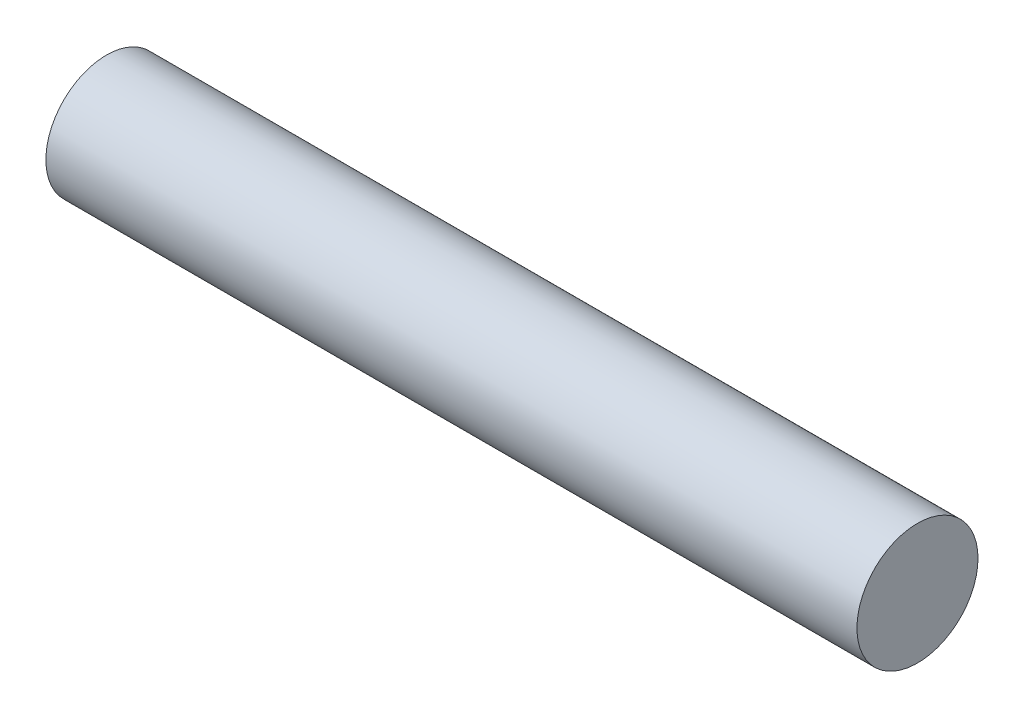
ISO-10303-21;
HEADER;
FILE_DESCRIPTION(('STEP AP214'),'2;1');
FILE_NAME('part.step','',(''),(''),'','','');
FILE_SCHEMA(('AUTOMOTIVE_DESIGN { 1 0 10303 214 1 1 1 1 }'));
ENDSEC;
DATA;
#1=APPLICATION_CONTEXT('core data for automotive mechanical design processes');
#2=APPLICATION_PROTOCOL_DEFINITION('international standard','automotive_design',2000,#1);
#3=PRODUCT_CONTEXT('',#1,'mechanical');
#4=PRODUCT('Part','Part','',(#3));
#5=PRODUCT_RELATED_PRODUCT_CATEGORY('part','',(#4));
#6=PRODUCT_DEFINITION_FORMATION('','',#4);
#7=PRODUCT_DEFINITION_CONTEXT('part definition',#1,'design');
#8=PRODUCT_DEFINITION('design','',#6,#7);
#9=PRODUCT_DEFINITION_SHAPE('','',#8);
#10=(LENGTH_UNIT() NAMED_UNIT(*) SI_UNIT(.MILLI.,.METRE.));
#11=(NAMED_UNIT(*) PLANE_ANGLE_UNIT() SI_UNIT($,.RADIAN.));
#12=(NAMED_UNIT(*) SI_UNIT($,.STERADIAN.) SOLID_ANGLE_UNIT());
#13=UNCERTAINTY_MEASURE_WITH_UNIT(LENGTH_MEASURE(1.E-05),#10,'distance_accuracy_value','');
#14=(GEOMETRIC_REPRESENTATION_CONTEXT(3) GLOBAL_UNCERTAINTY_ASSIGNED_CONTEXT((#13)) GLOBAL_UNIT_ASSIGNED_CONTEXT((#10,
#11,#12)) REPRESENTATION_CONTEXT('',''));
#15=CARTESIAN_POINT('',(0.,0.,0.));
#16=DIRECTION('',(0.,0.,1.));
#17=DIRECTION('',(1.,0.,0.));
#18=AXIS2_PLACEMENT_3D('',#15,#16,#17);
#19=CARTESIAN_POINT('',(33.5,0.,0.));
#20=DIRECTION('',(-1.,0.,0.));
#21=DIRECTION('',(0.,0.,1.));
#22=AXIS2_PLACEMENT_3D('',#19,#20,#21);
#23=CYLINDRICAL_SURFACE('',#22,5.);
#24=CARTESIAN_POINT('',(33.5,0.,0.));
#25=DIRECTION('',(1.,0.,0.));
#26=DIRECTION('',(0.,0.,-1.));
#27=AXIS2_PLACEMENT_3D('',#24,#25,#26);
#28=CIRCLE('',#27,5.);
#29=CARTESIAN_POINT('',(33.5,0.,-5.));
#30=VERTEX_POINT('',#29);
#31=EDGE_CURVE('E10',#30,#30,#28,.T.);
#32=ORIENTED_EDGE('',*,*,#31,.F.);
#33=EDGE_LOOP('',(#32));
#34=FACE_BOUND('',#33,.T.);
#35=CARTESIAN_POINT('',(-33.5,0.,0.));
#36=DIRECTION('',(1.,0.,0.));
#37=DIRECTION('',(0.,0.,-1.));
#38=AXIS2_PLACEMENT_3D('',#35,#36,#37);
#39=CIRCLE('',#38,5.);
#40=CARTESIAN_POINT('',(-33.5,0.,-5.));
#41=VERTEX_POINT('',#40);
#42=EDGE_CURVE('E33',#41,#41,#39,.T.);
#43=ORIENTED_EDGE('',*,*,#42,.T.);
#44=EDGE_LOOP('',(#43));
#45=FACE_BOUND('',#44,.T.);
#46=ADVANCED_FACE('F30',(#34,#45),#23,.T.);
#47=CARTESIAN_POINT('',(33.5,0.,0.));
#48=DIRECTION('',(1.,0.,0.));
#49=DIRECTION('',(0.,0.,-1.));
#50=AXIS2_PLACEMENT_3D('',#47,#48,#49);
#51=PLANE('',#50);
#52=ORIENTED_EDGE('',*,*,#31,.T.);
#53=EDGE_LOOP('',(#52));
#54=FACE_BOUND('',#53,.T.);
#55=ADVANCED_FACE('F45',(#54),#51,.T.);
#56=CARTESIAN_POINT('',(-33.5,0.,0.));
#57=DIRECTION('',(1.,0.,0.));
#58=DIRECTION('',(0.,0.,-1.));
#59=AXIS2_PLACEMENT_3D('',#56,#57,#58);
#60=PLANE('',#59);
#61=ORIENTED_EDGE('',*,*,#42,.F.);
#62=EDGE_LOOP('',(#61));
#63=FACE_BOUND('',#62,.T.);
#64=ADVANCED_FACE('F43',(#63),#60,.F.);
#65=CLOSED_SHELL('',(#46,#55,#64));
#66=MANIFOLD_SOLID_BREP('B2',#65);
#67=ADVANCED_BREP_SHAPE_REPRESENTATION('',(#18,#66),#14);
#68=SHAPE_DEFINITION_REPRESENTATION(#9,#67);
ENDSEC;
END-ISO-10303-21;
